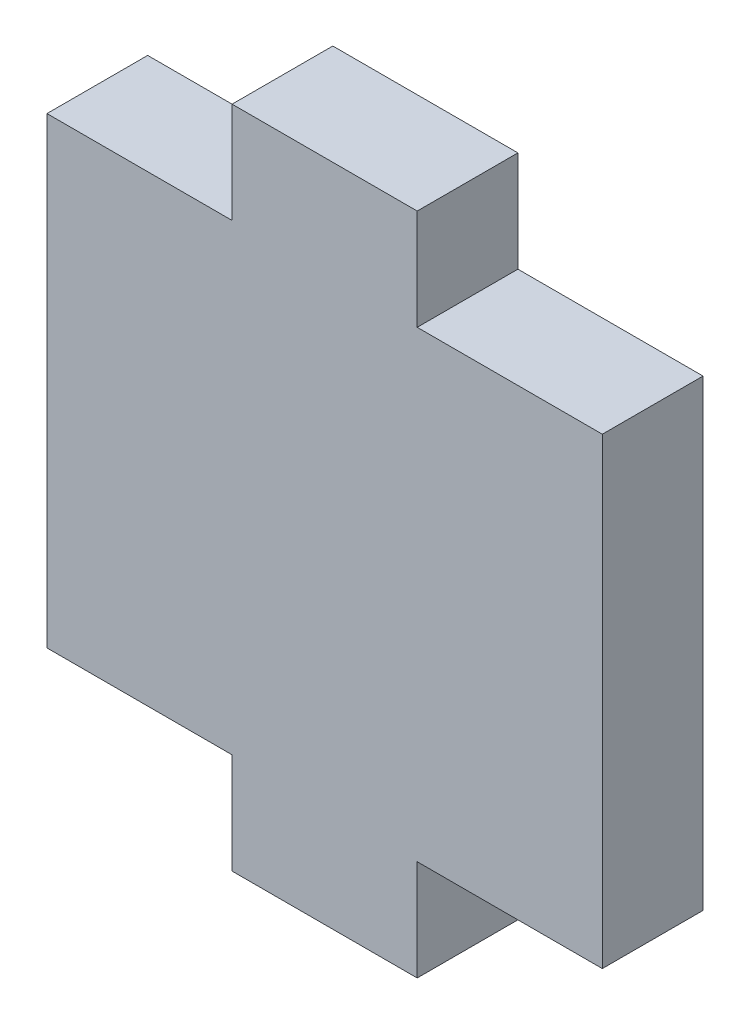
ISO-10303-21;
HEADER;
FILE_DESCRIPTION(('STEP AP214'),'2;1');
FILE_NAME('part.step','',(''),(''),'','','');
FILE_SCHEMA(('AUTOMOTIVE_DESIGN { 1 0 10303 214 1 1 1 1 }'));
ENDSEC;
DATA;
#1=APPLICATION_CONTEXT('core data for automotive mechanical design processes');
#2=APPLICATION_PROTOCOL_DEFINITION('international standard','automotive_design',2000,#1);
#3=PRODUCT_CONTEXT('',#1,'mechanical');
#4=PRODUCT('Part','Part','',(#3));
#5=PRODUCT_RELATED_PRODUCT_CATEGORY('part','',(#4));
#6=PRODUCT_DEFINITION_FORMATION('','',#4);
#7=PRODUCT_DEFINITION_CONTEXT('part definition',#1,'design');
#8=PRODUCT_DEFINITION('design','',#6,#7);
#9=PRODUCT_DEFINITION_SHAPE('','',#8);
#10=(LENGTH_UNIT() NAMED_UNIT(*) SI_UNIT(.MILLI.,.METRE.));
#11=(NAMED_UNIT(*) PLANE_ANGLE_UNIT() SI_UNIT($,.RADIAN.));
#12=(NAMED_UNIT(*) SI_UNIT($,.STERADIAN.) SOLID_ANGLE_UNIT());
#13=UNCERTAINTY_MEASURE_WITH_UNIT(LENGTH_MEASURE(1.E-05),#10,'distance_accuracy_value','');
#14=(GEOMETRIC_REPRESENTATION_CONTEXT(3) GLOBAL_UNCERTAINTY_ASSIGNED_CONTEXT((#13)) GLOBAL_UNIT_ASSIGNED_CONTEXT((#10,
#11,#12)) REPRESENTATION_CONTEXT('',''));
#15=CARTESIAN_POINT('',(0.,0.,0.));
#16=DIRECTION('',(0.,0.,1.));
#17=DIRECTION('',(1.,0.,0.));
#18=AXIS2_PLACEMENT_3D('',#15,#16,#17);
#19=CARTESIAN_POINT('',(0.,0.,5.44));
#20=DIRECTION('',(1.,0.,0.));
#21=DIRECTION('',(0.,0.,-1.));
#22=AXIS2_PLACEMENT_3D('',#19,#20,#21);
#23=PLANE('',#22);
#24=DIRECTION('',(0.,-1.,0.));
#25=VECTOR('',#24,1.);
#26=CARTESIAN_POINT('',(0.,0.,0.));
#27=LINE('',#26,#25);
#28=CARTESIAN_POINT('',(0.,25.,0.));
#29=VERTEX_POINT('',#28);
#30=CARTESIAN_POINT('',(0.,0.,0.));
#31=VERTEX_POINT('',#30);
#32=EDGE_CURVE('E151',#29,#31,#27,.T.);
#33=ORIENTED_EDGE('',*,*,#32,.T.);
#34=DIRECTION('',(0.,0.,-1.));
#35=VECTOR('',#34,1.);
#36=CARTESIAN_POINT('',(0.,0.,5.44));
#37=LINE('',#36,#35);
#38=CARTESIAN_POINT('',(0.,0.,5.44));
#39=VERTEX_POINT('',#38);
#40=EDGE_CURVE('E11',#39,#31,#37,.T.);
#41=ORIENTED_EDGE('',*,*,#40,.F.);
#42=DIRECTION('',(0.,-1.,0.));
#43=VECTOR('',#42,1.);
#44=CARTESIAN_POINT('',(0.,0.,5.44));
#45=LINE('',#44,#43);
#46=CARTESIAN_POINT('',(0.,25.,5.44));
#47=VERTEX_POINT('',#46);
#48=EDGE_CURVE('E173',#47,#39,#45,.T.);
#49=ORIENTED_EDGE('',*,*,#48,.F.);
#50=DIRECTION('',(0.,0.,-1.));
#51=VECTOR('',#50,1.);
#52=CARTESIAN_POINT('',(0.,25.,5.44));
#53=LINE('',#52,#51);
#54=EDGE_CURVE('E147',#47,#29,#53,.T.);
#55=ORIENTED_EDGE('',*,*,#54,.T.);
#56=EDGE_LOOP('',(#33,#41,#49,#55));
#57=FACE_BOUND('',#56,.T.);
#58=ADVANCED_FACE('F31',(#57),#23,.F.);
#59=CARTESIAN_POINT('',(0.,0.,5.44));
#60=DIRECTION('',(0.,1.,0.));
#61=DIRECTION('',(0.,0.,1.));
#62=AXIS2_PLACEMENT_3D('',#59,#60,#61);
#63=PLANE('',#62);
#64=DIRECTION('',(1.,0.,0.));
#65=VECTOR('',#64,1.);
#66=CARTESIAN_POINT('',(0.,0.,0.));
#67=LINE('',#66,#65);
#68=CARTESIAN_POINT('',(10.,0.,0.));
#69=VERTEX_POINT('',#68);
#70=EDGE_CURVE('E154',#31,#69,#67,.T.);
#71=ORIENTED_EDGE('',*,*,#70,.T.);
#72=DIRECTION('',(0.,0.,-1.));
#73=VECTOR('',#72,1.);
#74=CARTESIAN_POINT('',(10.,0.,5.44));
#75=LINE('',#74,#73);
#76=CARTESIAN_POINT('',(10.,0.,5.44));
#77=VERTEX_POINT('',#76);
#78=EDGE_CURVE('E39',#77,#69,#75,.T.);
#79=ORIENTED_EDGE('',*,*,#78,.F.);
#80=DIRECTION('',(1.,0.,0.));
#81=VECTOR('',#80,1.);
#82=CARTESIAN_POINT('',(0.,0.,5.44));
#83=LINE('',#82,#81);
#84=EDGE_CURVE('E102',#39,#77,#83,.T.);
#85=ORIENTED_EDGE('',*,*,#84,.F.);
#86=ORIENTED_EDGE('',*,*,#40,.T.);
#87=EDGE_LOOP('',(#71,#79,#85,#86));
#88=FACE_BOUND('',#87,.T.);
#89=ADVANCED_FACE('F251',(#88),#63,.F.);
#90=CARTESIAN_POINT('',(10.,0.,5.44));
#91=DIRECTION('',(1.,0.,0.));
#92=DIRECTION('',(0.,0.,-1.));
#93=AXIS2_PLACEMENT_3D('',#90,#91,#92);
#94=PLANE('',#93);
#95=DIRECTION('',(0.,-1.,0.));
#96=VECTOR('',#95,1.);
#97=CARTESIAN_POINT('',(10.,0.,0.));
#98=LINE('',#97,#96);
#99=CARTESIAN_POINT('',(10.,-5.44,0.));
#100=VERTEX_POINT('',#99);
#101=EDGE_CURVE('E156',#69,#100,#98,.T.);
#102=ORIENTED_EDGE('',*,*,#101,.T.);
#103=DIRECTION('',(0.,0.,-1.));
#104=VECTOR('',#103,1.);
#105=CARTESIAN_POINT('',(10.,-5.44,5.44));
#106=LINE('',#105,#104);
#107=CARTESIAN_POINT('',(10.,-5.44,5.44));
#108=VERTEX_POINT('',#107);
#109=EDGE_CURVE('E192',#108,#100,#106,.T.);
#110=ORIENTED_EDGE('',*,*,#109,.F.);
#111=DIRECTION('',(0.,-1.,0.));
#112=VECTOR('',#111,1.);
#113=CARTESIAN_POINT('',(10.,0.,5.44));
#114=LINE('',#113,#112);
#115=EDGE_CURVE('E200',#77,#108,#114,.T.);
#116=ORIENTED_EDGE('',*,*,#115,.F.);
#117=ORIENTED_EDGE('',*,*,#78,.T.);
#118=EDGE_LOOP('',(#102,#110,#116,#117));
#119=FACE_BOUND('',#118,.T.);
#120=ADVANCED_FACE('F198',(#119),#94,.F.);
#121=CARTESIAN_POINT('',(10.,-5.44,5.44));
#122=DIRECTION('',(0.,1.,0.));
#123=DIRECTION('',(0.,0.,1.));
#124=AXIS2_PLACEMENT_3D('',#121,#122,#123);
#125=PLANE('',#124);
#126=DIRECTION('',(1.,0.,0.));
#127=VECTOR('',#126,1.);
#128=CARTESIAN_POINT('',(10.,-5.44,0.));
#129=LINE('',#128,#127);
#130=CARTESIAN_POINT('',(20.,-5.44,0.));
#131=VERTEX_POINT('',#130);
#132=EDGE_CURVE('E158',#100,#131,#129,.T.);
#133=ORIENTED_EDGE('',*,*,#132,.T.);
#134=DIRECTION('',(0.,0.,-1.));
#135=VECTOR('',#134,1.);
#136=CARTESIAN_POINT('',(20.,-5.44,5.44));
#137=LINE('',#136,#135);
#138=CARTESIAN_POINT('',(20.,-5.44,5.44));
#139=VERTEX_POINT('',#138);
#140=EDGE_CURVE('E189',#139,#131,#137,.T.);
#141=ORIENTED_EDGE('',*,*,#140,.F.);
#142=DIRECTION('',(1.,0.,0.));
#143=VECTOR('',#142,1.);
#144=CARTESIAN_POINT('',(10.,-5.44,5.44));
#145=LINE('',#144,#143);
#146=EDGE_CURVE('E218',#108,#139,#145,.T.);
#147=ORIENTED_EDGE('',*,*,#146,.F.);
#148=ORIENTED_EDGE('',*,*,#109,.T.);
#149=EDGE_LOOP('',(#133,#141,#147,#148));
#150=FACE_BOUND('',#149,.T.);
#151=ADVANCED_FACE('F209',(#150),#125,.F.);
#152=CARTESIAN_POINT('',(20.,0.,5.44));
#153=DIRECTION('',(-1.,0.,0.));
#154=DIRECTION('',(0.,0.,1.));
#155=AXIS2_PLACEMENT_3D('',#152,#153,#154);
#156=PLANE('',#155);
#157=DIRECTION('',(0.,1.,0.));
#158=VECTOR('',#157,1.);
#159=CARTESIAN_POINT('',(20.,0.,0.));
#160=LINE('',#159,#158);
#161=CARTESIAN_POINT('',(20.,0.,0.));
#162=VERTEX_POINT('',#161);
#163=EDGE_CURVE('E160',#131,#162,#160,.T.);
#164=ORIENTED_EDGE('',*,*,#163,.T.);
#165=DIRECTION('',(0.,0.,-1.));
#166=VECTOR('',#165,1.);
#167=CARTESIAN_POINT('',(20.,0.,5.44));
#168=LINE('',#167,#166);
#169=CARTESIAN_POINT('',(20.,0.,5.44));
#170=VERTEX_POINT('',#169);
#171=EDGE_CURVE('E186',#170,#162,#168,.T.);
#172=ORIENTED_EDGE('',*,*,#171,.F.);
#173=DIRECTION('',(0.,1.,0.));
#174=VECTOR('',#173,1.);
#175=CARTESIAN_POINT('',(20.,0.,5.44));
#176=LINE('',#175,#174);
#177=EDGE_CURVE('E215',#139,#170,#176,.T.);
#178=ORIENTED_EDGE('',*,*,#177,.F.);
#179=ORIENTED_EDGE('',*,*,#140,.T.);
#180=EDGE_LOOP('',(#164,#172,#178,#179));
#181=FACE_BOUND('',#180,.T.);
#182=ADVANCED_FACE('F213',(#181),#156,.F.);
#183=CARTESIAN_POINT('',(20.,0.,5.44));
#184=DIRECTION('',(0.,1.,0.));
#185=DIRECTION('',(0.,0.,1.));
#186=AXIS2_PLACEMENT_3D('',#183,#184,#185);
#187=PLANE('',#186);
#188=DIRECTION('',(1.,0.,0.));
#189=VECTOR('',#188,1.);
#190=CARTESIAN_POINT('',(20.,0.,0.));
#191=LINE('',#190,#189);
#192=CARTESIAN_POINT('',(30.,0.,0.));
#193=VERTEX_POINT('',#192);
#194=EDGE_CURVE('E162',#162,#193,#191,.T.);
#195=ORIENTED_EDGE('',*,*,#194,.T.);
#196=DIRECTION('',(0.,0.,-1.));
#197=VECTOR('',#196,1.);
#198=CARTESIAN_POINT('',(30.,0.,5.44));
#199=LINE('',#198,#197);
#200=CARTESIAN_POINT('',(30.,0.,5.44));
#201=VERTEX_POINT('',#200);
#202=EDGE_CURVE('E183',#201,#193,#199,.T.);
#203=ORIENTED_EDGE('',*,*,#202,.F.);
#204=DIRECTION('',(1.,0.,0.));
#205=VECTOR('',#204,1.);
#206=CARTESIAN_POINT('',(20.,0.,5.44));
#207=LINE('',#206,#205);
#208=EDGE_CURVE('E217',#170,#201,#207,.T.);
#209=ORIENTED_EDGE('',*,*,#208,.F.);
#210=ORIENTED_EDGE('',*,*,#171,.T.);
#211=EDGE_LOOP('',(#195,#203,#209,#210));
#212=FACE_BOUND('',#211,.T.);
#213=ADVANCED_FACE('F264',(#212),#187,.F.);
#214=CARTESIAN_POINT('',(30.,0.,5.44));
#215=DIRECTION('',(-1.,0.,0.));
#216=DIRECTION('',(0.,0.,1.));
#217=AXIS2_PLACEMENT_3D('',#214,#215,#216);
#218=PLANE('',#217);
#219=DIRECTION('',(0.,1.,0.));
#220=VECTOR('',#219,1.);
#221=CARTESIAN_POINT('',(30.,0.,0.));
#222=LINE('',#221,#220);
#223=CARTESIAN_POINT('',(30.,25.,0.));
#224=VERTEX_POINT('',#223);
#225=EDGE_CURVE('E164',#193,#224,#222,.T.);
#226=ORIENTED_EDGE('',*,*,#225,.T.);
#227=DIRECTION('',(0.,0.,-1.));
#228=VECTOR('',#227,1.);
#229=CARTESIAN_POINT('',(30.,25.,5.44));
#230=LINE('',#229,#228);
#231=CARTESIAN_POINT('',(30.,25.,5.44));
#232=VERTEX_POINT('',#231);
#233=EDGE_CURVE('E180',#232,#224,#230,.T.);
#234=ORIENTED_EDGE('',*,*,#233,.F.);
#235=DIRECTION('',(0.,1.,0.));
#236=VECTOR('',#235,1.);
#237=CARTESIAN_POINT('',(30.,0.,5.44));
#238=LINE('',#237,#236);
#239=EDGE_CURVE('E220',#201,#232,#238,.T.);
#240=ORIENTED_EDGE('',*,*,#239,.F.);
#241=ORIENTED_EDGE('',*,*,#202,.T.);
#242=EDGE_LOOP('',(#226,#234,#240,#241));
#243=FACE_BOUND('',#242,.T.);
#244=ADVANCED_FACE('F267',(#243),#218,.F.);
#245=CARTESIAN_POINT('',(30.,25.,5.44));
#246=DIRECTION('',(0.,-1.,0.));
#247=DIRECTION('',(0.,0.,-1.));
#248=AXIS2_PLACEMENT_3D('',#245,#246,#247);
#249=PLANE('',#248);
#250=DIRECTION('',(-1.,0.,0.));
#251=VECTOR('',#250,1.);
#252=CARTESIAN_POINT('',(30.,25.,0.));
#253=LINE('',#252,#251);
#254=CARTESIAN_POINT('',(20.,25.,0.));
#255=VERTEX_POINT('',#254);
#256=EDGE_CURVE('E166',#224,#255,#253,.T.);
#257=ORIENTED_EDGE('',*,*,#256,.T.);
#258=DIRECTION('',(0.,0.,-1.));
#259=VECTOR('',#258,1.);
#260=CARTESIAN_POINT('',(20.,25.,5.44));
#261=LINE('',#260,#259);
#262=CARTESIAN_POINT('',(20.,25.,5.44));
#263=VERTEX_POINT('',#262);
#264=EDGE_CURVE('E177',#263,#255,#261,.T.);
#265=ORIENTED_EDGE('',*,*,#264,.F.);
#266=DIRECTION('',(-1.,0.,0.));
#267=VECTOR('',#266,1.);
#268=CARTESIAN_POINT('',(30.,25.,5.44));
#269=LINE('',#268,#267);
#270=EDGE_CURVE('E226',#232,#263,#269,.T.);
#271=ORIENTED_EDGE('',*,*,#270,.F.);
#272=ORIENTED_EDGE('',*,*,#233,.T.);
#273=EDGE_LOOP('',(#257,#265,#271,#272));
#274=FACE_BOUND('',#273,.T.);
#275=ADVANCED_FACE('F232',(#274),#249,.F.);
#276=CARTESIAN_POINT('',(20.,30.44,5.44));
#277=DIRECTION('',(-1.,0.,0.));
#278=DIRECTION('',(0.,0.,1.));
#279=AXIS2_PLACEMENT_3D('',#276,#277,#278);
#280=PLANE('',#279);
#281=DIRECTION('',(0.,1.,0.));
#282=VECTOR('',#281,1.);
#283=CARTESIAN_POINT('',(20.,30.44,0.));
#284=LINE('',#283,#282);
#285=CARTESIAN_POINT('',(20.,30.44,0.));
#286=VERTEX_POINT('',#285);
#287=EDGE_CURVE('E168',#255,#286,#284,.T.);
#288=ORIENTED_EDGE('',*,*,#287,.T.);
#289=DIRECTION('',(0.,0.,-1.));
#290=VECTOR('',#289,1.);
#291=CARTESIAN_POINT('',(20.,30.44,5.44));
#292=LINE('',#291,#290);
#293=CARTESIAN_POINT('',(20.,30.44,5.44));
#294=VERTEX_POINT('',#293);
#295=EDGE_CURVE('E142',#294,#286,#292,.T.);
#296=ORIENTED_EDGE('',*,*,#295,.F.);
#297=DIRECTION('',(0.,1.,0.));
#298=VECTOR('',#297,1.);
#299=CARTESIAN_POINT('',(20.,30.44,5.44));
#300=LINE('',#299,#298);
#301=EDGE_CURVE('E133',#263,#294,#300,.T.);
#302=ORIENTED_EDGE('',*,*,#301,.F.);
#303=ORIENTED_EDGE('',*,*,#264,.T.);
#304=EDGE_LOOP('',(#288,#296,#302,#303));
#305=FACE_BOUND('',#304,.T.);
#306=ADVANCED_FACE('F236',(#305),#280,.F.);
#307=CARTESIAN_POINT('',(10.,30.44,5.44));
#308=DIRECTION('',(0.,-1.,0.));
#309=DIRECTION('',(0.,0.,-1.));
#310=AXIS2_PLACEMENT_3D('',#307,#308,#309);
#311=PLANE('',#310);
#312=DIRECTION('',(-1.,0.,0.));
#313=VECTOR('',#312,1.);
#314=CARTESIAN_POINT('',(10.,30.44,0.));
#315=LINE('',#314,#313);
#316=CARTESIAN_POINT('',(10.,30.44,0.));
#317=VERTEX_POINT('',#316);
#318=EDGE_CURVE('E141',#286,#317,#315,.T.);
#319=ORIENTED_EDGE('',*,*,#318,.T.);
#320=DIRECTION('',(0.,0.,-1.));
#321=VECTOR('',#320,1.);
#322=CARTESIAN_POINT('',(10.,30.44,5.44));
#323=LINE('',#322,#321);
#324=CARTESIAN_POINT('',(10.,30.44,5.44));
#325=VERTEX_POINT('',#324);
#326=EDGE_CURVE('E138',#325,#317,#323,.T.);
#327=ORIENTED_EDGE('',*,*,#326,.F.);
#328=DIRECTION('',(-1.,0.,0.));
#329=VECTOR('',#328,1.);
#330=CARTESIAN_POINT('',(10.,30.44,5.44));
#331=LINE('',#330,#329);
#332=EDGE_CURVE('E127',#294,#325,#331,.T.);
#333=ORIENTED_EDGE('',*,*,#332,.F.);
#334=ORIENTED_EDGE('',*,*,#295,.T.);
#335=EDGE_LOOP('',(#319,#327,#333,#334));
#336=FACE_BOUND('',#335,.T.);
#337=ADVANCED_FACE('F139',(#336),#311,.F.);
#338=CARTESIAN_POINT('',(10.,30.44,5.44));
#339=DIRECTION('',(1.,0.,0.));
#340=DIRECTION('',(0.,1.,0.));
#341=AXIS2_PLACEMENT_3D('',#338,#339,#340);
#342=PLANE('',#341);
#343=DIRECTION('',(0.,-1.,0.));
#344=VECTOR('',#343,1.);
#345=CARTESIAN_POINT('',(10.,30.44,0.));
#346=LINE('',#345,#344);
#347=CARTESIAN_POINT('',(10.,25.,0.));
#348=VERTEX_POINT('',#347);
#349=EDGE_CURVE('E88',#317,#348,#346,.T.);
#350=ORIENTED_EDGE('',*,*,#349,.T.);
#351=DIRECTION('',(0.,0.,-1.));
#352=VECTOR('',#351,1.);
#353=CARTESIAN_POINT('',(10.,25.,5.44));
#354=LINE('',#353,#352);
#355=CARTESIAN_POINT('',(10.,25.,5.44));
#356=VERTEX_POINT('',#355);
#357=EDGE_CURVE('E143',#356,#348,#354,.T.);
#358=ORIENTED_EDGE('',*,*,#357,.F.);
#359=DIRECTION('',(0.,-1.,0.));
#360=VECTOR('',#359,1.);
#361=CARTESIAN_POINT('',(10.,30.44,5.44));
#362=LINE('',#361,#360);
#363=EDGE_CURVE('E131',#325,#356,#362,.T.);
#364=ORIENTED_EDGE('',*,*,#363,.F.);
#365=ORIENTED_EDGE('',*,*,#326,.T.);
#366=EDGE_LOOP('',(#350,#358,#364,#365));
#367=FACE_BOUND('',#366,.T.);
#368=ADVANCED_FACE('F145',(#367),#342,.F.);
#369=CARTESIAN_POINT('',(0.,25.,5.44));
#370=DIRECTION('',(0.,-1.,0.));
#371=DIRECTION('',(1.,0.,0.));
#372=AXIS2_PLACEMENT_3D('',#369,#370,#371);
#373=PLANE('',#372);
#374=DIRECTION('',(-1.,0.,0.));
#375=VECTOR('',#374,1.);
#376=CARTESIAN_POINT('',(0.,25.,0.));
#377=LINE('',#376,#375);
#378=EDGE_CURVE('E94',#348,#29,#377,.T.);
#379=ORIENTED_EDGE('',*,*,#378,.T.);
#380=ORIENTED_EDGE('',*,*,#54,.F.);
#381=DIRECTION('',(-1.,0.,0.));
#382=VECTOR('',#381,1.);
#383=CARTESIAN_POINT('',(0.,25.,5.44));
#384=LINE('',#383,#382);
#385=EDGE_CURVE('E47',#356,#47,#384,.T.);
#386=ORIENTED_EDGE('',*,*,#385,.F.);
#387=ORIENTED_EDGE('',*,*,#357,.T.);
#388=EDGE_LOOP('',(#379,#380,#386,#387));
#389=FACE_BOUND('',#388,.T.);
#390=ADVANCED_FACE('F240',(#389),#373,.F.);
#391=CARTESIAN_POINT('',(0.,25.,5.44));
#392=DIRECTION('',(0.,0.,-1.));
#393=DIRECTION('',(-1.,0.,0.));
#394=AXIS2_PLACEMENT_3D('',#391,#392,#393);
#395=PLANE('',#394);
#396=ORIENTED_EDGE('',*,*,#48,.T.);
#397=ORIENTED_EDGE('',*,*,#84,.T.);
#398=ORIENTED_EDGE('',*,*,#115,.T.);
#399=ORIENTED_EDGE('',*,*,#146,.T.);
#400=ORIENTED_EDGE('',*,*,#177,.T.);
#401=ORIENTED_EDGE('',*,*,#208,.T.);
#402=ORIENTED_EDGE('',*,*,#239,.T.);
#403=ORIENTED_EDGE('',*,*,#270,.T.);
#404=ORIENTED_EDGE('',*,*,#301,.T.);
#405=ORIENTED_EDGE('',*,*,#332,.T.);
#406=ORIENTED_EDGE('',*,*,#363,.T.);
#407=ORIENTED_EDGE('',*,*,#385,.T.);
#408=EDGE_LOOP('',(#396,#397,#398,#399,#400,#401,#402,#403,#404,#405,#406,#407));
#409=FACE_BOUND('',#408,.T.);
#410=ADVANCED_FACE('F129',(#409),#395,.F.);
#411=CARTESIAN_POINT('',(0.,25.,0.));
#412=DIRECTION('',(0.,0.,-1.));
#413=DIRECTION('',(-1.,0.,0.));
#414=AXIS2_PLACEMENT_3D('',#411,#412,#413);
#415=PLANE('',#414);
#416=ORIENTED_EDGE('',*,*,#32,.F.);
#417=ORIENTED_EDGE('',*,*,#378,.F.);
#418=ORIENTED_EDGE('',*,*,#349,.F.);
#419=ORIENTED_EDGE('',*,*,#318,.F.);
#420=ORIENTED_EDGE('',*,*,#287,.F.);
#421=ORIENTED_EDGE('',*,*,#256,.F.);
#422=ORIENTED_EDGE('',*,*,#225,.F.);
#423=ORIENTED_EDGE('',*,*,#194,.F.);
#424=ORIENTED_EDGE('',*,*,#163,.F.);
#425=ORIENTED_EDGE('',*,*,#132,.F.);
#426=ORIENTED_EDGE('',*,*,#101,.F.);
#427=ORIENTED_EDGE('',*,*,#70,.F.);
#428=EDGE_LOOP('',(#416,#417,#418,#419,#420,#421,#422,#423,#424,#425,#426,#427));
#429=FACE_BOUND('',#428,.T.);
#430=ADVANCED_FACE('F204',(#429),#415,.T.);
#431=CLOSED_SHELL('',(#58,#89,#120,#151,#182,#213,#244,#275,#306,#337,#368,#390,#410,#430));
#432=MANIFOLD_SOLID_BREP('B2',#431);
#433=ADVANCED_BREP_SHAPE_REPRESENTATION('',(#18,#432),#14);
#434=SHAPE_DEFINITION_REPRESENTATION(#9,#433);
ENDSEC;
END-ISO-10303-21;
